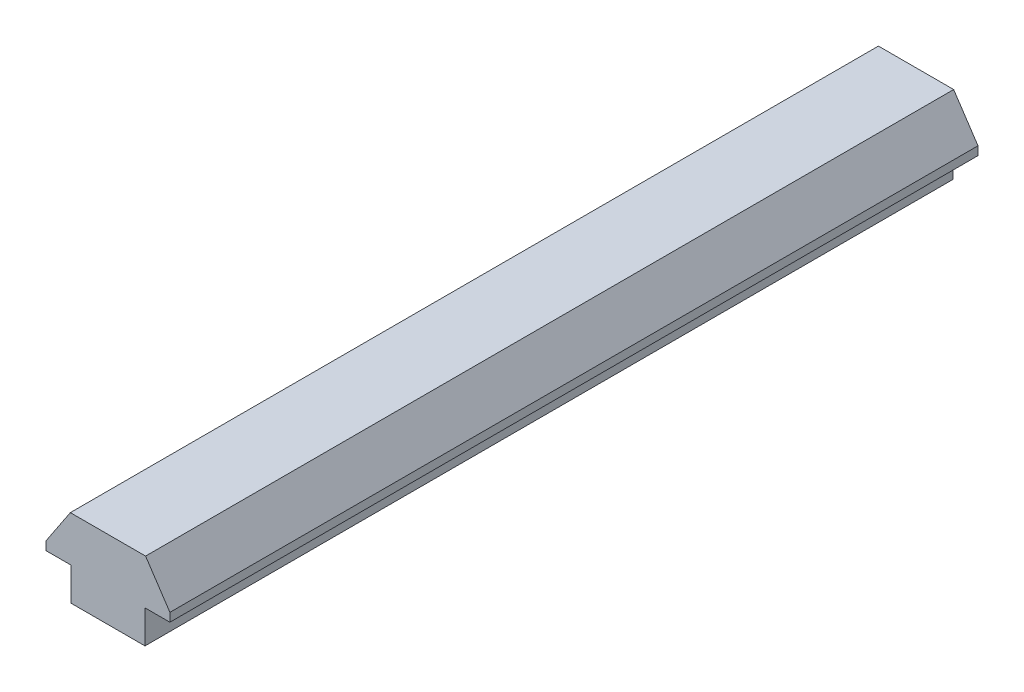
ISO-10303-21;
HEADER;
FILE_DESCRIPTION(('STEP AP214'),'2;1');
FILE_NAME('part.step','',(''),(''),'','','');
FILE_SCHEMA(('AUTOMOTIVE_DESIGN { 1 0 10303 214 1 1 1 1 }'));
ENDSEC;
DATA;
#1=APPLICATION_CONTEXT('core data for automotive mechanical design processes');
#2=APPLICATION_PROTOCOL_DEFINITION('international standard','automotive_design',2000,#1);
#3=PRODUCT_CONTEXT('',#1,'mechanical');
#4=PRODUCT('Part','Part','',(#3));
#5=PRODUCT_RELATED_PRODUCT_CATEGORY('part','',(#4));
#6=PRODUCT_DEFINITION_FORMATION('','',#4);
#7=PRODUCT_DEFINITION_CONTEXT('part definition',#1,'design');
#8=PRODUCT_DEFINITION('design','',#6,#7);
#9=PRODUCT_DEFINITION_SHAPE('','',#8);
#10=(LENGTH_UNIT() NAMED_UNIT(*) SI_UNIT(.MILLI.,.METRE.));
#11=(NAMED_UNIT(*) PLANE_ANGLE_UNIT() SI_UNIT($,.RADIAN.));
#12=(NAMED_UNIT(*) SI_UNIT($,.STERADIAN.) SOLID_ANGLE_UNIT());
#13=UNCERTAINTY_MEASURE_WITH_UNIT(LENGTH_MEASURE(1.E-05),#10,'distance_accuracy_value','');
#14=(GEOMETRIC_REPRESENTATION_CONTEXT(3) GLOBAL_UNCERTAINTY_ASSIGNED_CONTEXT((#13)) GLOBAL_UNIT_ASSIGNED_CONTEXT((#10,
#11,#12)) REPRESENTATION_CONTEXT('',''));
#15=CARTESIAN_POINT('',(0.,0.,0.));
#16=DIRECTION('',(0.,0.,1.));
#17=DIRECTION('',(1.,0.,0.));
#18=AXIS2_PLACEMENT_3D('',#15,#16,#17);
#19=CARTESIAN_POINT('',(-2.75,2.45,66.0210048995163));
#20=DIRECTION('',(1.,0.,0.));
#21=DIRECTION('',(0.,1.,0.));
#22=AXIS2_PLACEMENT_3D('',#19,#20,#21);
#23=PLANE('',#22);
#24=DIRECTION('',(0.,-1.,0.));
#25=VECTOR('',#24,1.);
#26=CARTESIAN_POINT('',(-2.74999999999975,2.44999999999946,60.));
#27=LINE('',#26,#25);
#28=CARTESIAN_POINT('',(-2.75,2.45,60.));
#29=VERTEX_POINT('',#28);
#30=CARTESIAN_POINT('',(-2.74999999999999,0.,60.));
#31=VERTEX_POINT('',#30);
#32=EDGE_CURVE('E205',#29,#31,#27,.T.);
#33=ORIENTED_EDGE('',*,*,#32,.F.);
#34=DIRECTION('',(0.,0.,-1.));
#35=VECTOR('',#34,1.);
#36=CARTESIAN_POINT('',(-2.75,2.45,66.0210048995163));
#37=LINE('',#36,#35);
#38=CARTESIAN_POINT('',(-2.75,2.45,0.));
#39=VERTEX_POINT('',#38);
#40=EDGE_CURVE('E133',#29,#39,#37,.T.);
#41=ORIENTED_EDGE('',*,*,#40,.T.);
#42=DIRECTION('',(0.,-1.,0.));
#43=VECTOR('',#42,1.);
#44=CARTESIAN_POINT('',(-2.75,2.45,0.));
#45=LINE('',#44,#43);
#46=CARTESIAN_POINT('',(-2.74999999999999,0.,0.));
#47=VERTEX_POINT('',#46);
#48=EDGE_CURVE('E136',#39,#47,#45,.T.);
#49=ORIENTED_EDGE('',*,*,#48,.T.);
#50=DIRECTION('',(0.,0.,-1.));
#51=VECTOR('',#50,1.);
#52=CARTESIAN_POINT('',(-2.74999999999999,0.,66.0210048995163));
#53=LINE('',#52,#51);
#54=EDGE_CURVE('E217',#31,#47,#53,.T.);
#55=ORIENTED_EDGE('',*,*,#54,.F.);
#56=EDGE_LOOP('',(#33,#41,#49,#55));
#57=FACE_BOUND('',#56,.T.);
#58=ADVANCED_FACE('F33',(#57),#23,.F.);
#59=CARTESIAN_POINT('',(-2.74999999999999,0.,66.0210048995163));
#60=DIRECTION('',(0.,1.,0.));
#61=DIRECTION('',(0.,0.,1.));
#62=AXIS2_PLACEMENT_3D('',#59,#60,#61);
#63=PLANE('',#62);
#64=DIRECTION('',(1.,0.,0.));
#65=VECTOR('',#64,1.);
#66=CARTESIAN_POINT('',(-2.74999999999999,0.,60.));
#67=LINE('',#66,#65);
#68=CARTESIAN_POINT('',(2.74999999999999,0.,60.));
#69=VERTEX_POINT('',#68);
#70=EDGE_CURVE('E43',#31,#69,#67,.T.);
#71=ORIENTED_EDGE('',*,*,#70,.F.);
#72=ORIENTED_EDGE('',*,*,#54,.T.);
#73=DIRECTION('',(1.,0.,0.));
#74=VECTOR('',#73,1.);
#75=CARTESIAN_POINT('',(-2.74999999999999,0.,0.));
#76=LINE('',#75,#74);
#77=CARTESIAN_POINT('',(2.74999999999999,0.,0.));
#78=VERTEX_POINT('',#77);
#79=EDGE_CURVE('E222',#47,#78,#76,.T.);
#80=ORIENTED_EDGE('',*,*,#79,.T.);
#81=DIRECTION('',(0.,0.,-1.));
#82=VECTOR('',#81,1.);
#83=CARTESIAN_POINT('',(2.74999999999999,0.,66.0210048995163));
#84=LINE('',#83,#82);
#85=EDGE_CURVE('E51',#69,#78,#84,.T.);
#86=ORIENTED_EDGE('',*,*,#85,.F.);
#87=EDGE_LOOP('',(#71,#72,#80,#86));
#88=FACE_BOUND('',#87,.T.);
#89=ADVANCED_FACE('F231',(#88),#63,.F.);
#90=CARTESIAN_POINT('',(2.75,2.45,66.0210048995163));
#91=DIRECTION('',(-1.,0.,0.));
#92=DIRECTION('',(0.,-1.,0.));
#93=AXIS2_PLACEMENT_3D('',#90,#91,#92);
#94=PLANE('',#93);
#95=DIRECTION('',(0.,1.,0.));
#96=VECTOR('',#95,1.);
#97=CARTESIAN_POINT('',(2.75000000000027,2.44999999999946,60.));
#98=LINE('',#97,#96);
#99=CARTESIAN_POINT('',(2.75,2.45,60.));
#100=VERTEX_POINT('',#99);
#101=EDGE_CURVE('E11',#69,#100,#98,.T.);
#102=ORIENTED_EDGE('',*,*,#101,.F.);
#103=ORIENTED_EDGE('',*,*,#85,.T.);
#104=DIRECTION('',(0.,1.,0.));
#105=VECTOR('',#104,1.);
#106=CARTESIAN_POINT('',(2.75,2.45,0.));
#107=LINE('',#106,#105);
#108=CARTESIAN_POINT('',(2.75,2.45,0.));
#109=VERTEX_POINT('',#108);
#110=EDGE_CURVE('E206',#78,#109,#107,.T.);
#111=ORIENTED_EDGE('',*,*,#110,.T.);
#112=DIRECTION('',(0.,0.,-1.));
#113=VECTOR('',#112,1.);
#114=CARTESIAN_POINT('',(2.75,2.45,66.0210048995163));
#115=LINE('',#114,#113);
#116=EDGE_CURVE('E204',#100,#109,#115,.T.);
#117=ORIENTED_EDGE('',*,*,#116,.F.);
#118=EDGE_LOOP('',(#102,#103,#111,#117));
#119=FACE_BOUND('',#118,.T.);
#120=ADVANCED_FACE('F246',(#119),#94,.F.);
#121=CARTESIAN_POINT('',(-2.74999999999999,0.,0.));
#122=DIRECTION('',(0.,0.,1.));
#123=DIRECTION('',(1.,0.,0.));
#124=AXIS2_PLACEMENT_3D('',#121,#122,#123);
#125=PLANE('',#124);
#126=ORIENTED_EDGE('',*,*,#48,.F.);
#127=DIRECTION('',(1.,0.,0.));
#128=VECTOR('',#127,1.);
#129=CARTESIAN_POINT('',(-4.6,2.45,0.));
#130=LINE('',#129,#128);
#131=CARTESIAN_POINT('',(-4.6,2.45,0.));
#132=VERTEX_POINT('',#131);
#133=EDGE_CURVE('E165',#132,#39,#130,.T.);
#134=ORIENTED_EDGE('',*,*,#133,.F.);
#135=DIRECTION('',(0.,-1.,0.));
#136=VECTOR('',#135,1.);
#137=CARTESIAN_POINT('',(-4.6,2.45,0.));
#138=LINE('',#137,#136);
#139=CARTESIAN_POINT('',(-4.6,3.085,0.));
#140=VERTEX_POINT('',#139);
#141=EDGE_CURVE('E141',#140,#132,#138,.T.);
#142=ORIENTED_EDGE('',*,*,#141,.F.);
#143=DIRECTION('',(-0.553850660177017,-0.832616025681396,0.));
#144=VECTOR('',#143,1.);
#145=CARTESIAN_POINT('',(-4.6,3.085,0.));
#146=LINE('',#145,#144);
#147=CARTESIAN_POINT('',(-2.794,5.8,0.));
#148=VERTEX_POINT('',#147);
#149=EDGE_CURVE('E118',#148,#140,#146,.T.);
#150=ORIENTED_EDGE('',*,*,#149,.F.);
#151=DIRECTION('',(-1.,0.,0.));
#152=VECTOR('',#151,1.);
#153=CARTESIAN_POINT('',(-2.794,5.8,0.));
#154=LINE('',#153,#152);
#155=CARTESIAN_POINT('',(2.794,5.8,0.));
#156=VERTEX_POINT('',#155);
#157=EDGE_CURVE('E114',#156,#148,#154,.T.);
#158=ORIENTED_EDGE('',*,*,#157,.F.);
#159=DIRECTION('',(-0.553850660177017,0.832616025681396,0.));
#160=VECTOR('',#159,1.);
#161=CARTESIAN_POINT('',(4.6,3.085,0.));
#162=LINE('',#161,#160);
#163=CARTESIAN_POINT('',(4.6,3.085,0.));
#164=VERTEX_POINT('',#163);
#165=EDGE_CURVE('E158',#164,#156,#162,.T.);
#166=ORIENTED_EDGE('',*,*,#165,.F.);
#167=DIRECTION('',(0.,1.,0.));
#168=VECTOR('',#167,1.);
#169=CARTESIAN_POINT('',(4.6,2.45,0.));
#170=LINE('',#169,#168);
#171=CARTESIAN_POINT('',(4.6,2.45,0.));
#172=VERTEX_POINT('',#171);
#173=EDGE_CURVE('E161',#172,#164,#170,.T.);
#174=ORIENTED_EDGE('',*,*,#173,.F.);
#175=EDGE_CURVE('E167',#109,#172,#130,.T.);
#176=ORIENTED_EDGE('',*,*,#175,.F.);
#177=ORIENTED_EDGE('',*,*,#110,.F.);
#178=ORIENTED_EDGE('',*,*,#79,.F.);
#179=EDGE_LOOP('',(#126,#134,#142,#150,#158,#166,#174,#176,#177,#178));
#180=FACE_BOUND('',#179,.T.);
#181=ADVANCED_FACE('F178',(#180),#125,.F.);
#182=CARTESIAN_POINT('',(13.75,-1.75000000000004,60.));
#183=DIRECTION('',(0.,0.,1.));
#184=DIRECTION('',(0.,1.,0.));
#185=AXIS2_PLACEMENT_3D('',#182,#183,#184);
#186=PLANE('',#185);
#187=ORIENTED_EDGE('',*,*,#32,.T.);
#188=ORIENTED_EDGE('',*,*,#70,.T.);
#189=ORIENTED_EDGE('',*,*,#101,.T.);
#190=DIRECTION('',(1.,0.,0.));
#191=VECTOR('',#190,1.);
#192=CARTESIAN_POINT('',(-4.6,2.45,60.));
#193=LINE('',#192,#191);
#194=CARTESIAN_POINT('',(4.6,2.45,60.));
#195=VERTEX_POINT('',#194);
#196=EDGE_CURVE('E150',#100,#195,#193,.T.);
#197=ORIENTED_EDGE('',*,*,#196,.T.);
#198=DIRECTION('',(0.,1.,0.));
#199=VECTOR('',#198,1.);
#200=CARTESIAN_POINT('',(4.6,2.45,60.));
#201=LINE('',#200,#199);
#202=CARTESIAN_POINT('',(4.6,3.085,60.));
#203=VERTEX_POINT('',#202);
#204=EDGE_CURVE('E138',#195,#203,#201,.T.);
#205=ORIENTED_EDGE('',*,*,#204,.T.);
#206=DIRECTION('',(-0.553850660177017,0.832616025681396,0.));
#207=VECTOR('',#206,1.);
#208=CARTESIAN_POINT('',(4.6,3.085,60.));
#209=LINE('',#208,#207);
#210=CARTESIAN_POINT('',(2.794,5.8,60.));
#211=VERTEX_POINT('',#210);
#212=EDGE_CURVE('E132',#203,#211,#209,.T.);
#213=ORIENTED_EDGE('',*,*,#212,.T.);
#214=DIRECTION('',(-1.,0.,0.));
#215=VECTOR('',#214,1.);
#216=CARTESIAN_POINT('',(-2.794,5.8,60.));
#217=LINE('',#216,#215);
#218=CARTESIAN_POINT('',(-2.794,5.8,60.));
#219=VERTEX_POINT('',#218);
#220=EDGE_CURVE('E111',#211,#219,#217,.T.);
#221=ORIENTED_EDGE('',*,*,#220,.T.);
#222=DIRECTION('',(-0.553850660177017,-0.832616025681396,0.));
#223=VECTOR('',#222,1.);
#224=CARTESIAN_POINT('',(-4.6,3.085,60.));
#225=LINE('',#224,#223);
#226=CARTESIAN_POINT('',(-4.6,3.085,60.));
#227=VERTEX_POINT('',#226);
#228=EDGE_CURVE('E121',#219,#227,#225,.T.);
#229=ORIENTED_EDGE('',*,*,#228,.T.);
#230=DIRECTION('',(0.,-1.,0.));
#231=VECTOR('',#230,1.);
#232=CARTESIAN_POINT('',(-4.6,2.45,60.));
#233=LINE('',#232,#231);
#234=CARTESIAN_POINT('',(-4.6,2.45,60.));
#235=VERTEX_POINT('',#234);
#236=EDGE_CURVE('E127',#227,#235,#233,.T.);
#237=ORIENTED_EDGE('',*,*,#236,.T.);
#238=EDGE_CURVE('E145',#235,#29,#193,.T.);
#239=ORIENTED_EDGE('',*,*,#238,.T.);
#240=EDGE_LOOP('',(#187,#188,#189,#197,#205,#213,#221,#229,#237,#239));
#241=FACE_BOUND('',#240,.T.);
#242=ADVANCED_FACE('F35',(#241),#186,.T.);
#243=CARTESIAN_POINT('',(-4.6,2.45,69.790939689325));
#244=DIRECTION('',(0.,1.,0.));
#245=DIRECTION('',(0.,0.,1.));
#246=AXIS2_PLACEMENT_3D('',#243,#244,#245);
#247=PLANE('',#246);
#248=ORIENTED_EDGE('',*,*,#196,.F.);
#249=ORIENTED_EDGE('',*,*,#116,.T.);
#250=ORIENTED_EDGE('',*,*,#175,.T.);
#251=DIRECTION('',(0.,0.,-1.));
#252=VECTOR('',#251,1.);
#253=CARTESIAN_POINT('',(4.6,2.45,69.790939689325));
#254=LINE('',#253,#252);
#255=EDGE_CURVE('E162',#195,#172,#254,.T.);
#256=ORIENTED_EDGE('',*,*,#255,.F.);
#257=EDGE_LOOP('',(#248,#249,#250,#256));
#258=FACE_BOUND('',#257,.T.);
#259=ADVANCED_FACE('F202',(#258),#247,.F.);
#260=CARTESIAN_POINT('',(-4.6,2.45,69.790939689325));
#261=DIRECTION('',(1.,0.,0.));
#262=DIRECTION('',(0.,0.,-1.));
#263=AXIS2_PLACEMENT_3D('',#260,#261,#262);
#264=PLANE('',#263);
#265=ORIENTED_EDGE('',*,*,#236,.F.);
#266=DIRECTION('',(0.,0.,-1.));
#267=VECTOR('',#266,1.);
#268=CARTESIAN_POINT('',(-4.6,3.085,69.790939689325));
#269=LINE('',#268,#267);
#270=EDGE_CURVE('E123',#227,#140,#269,.T.);
#271=ORIENTED_EDGE('',*,*,#270,.T.);
#272=ORIENTED_EDGE('',*,*,#141,.T.);
#273=DIRECTION('',(0.,0.,-1.));
#274=VECTOR('',#273,1.);
#275=CARTESIAN_POINT('',(-4.6,2.45,69.790939689325));
#276=LINE('',#275,#274);
#277=EDGE_CURVE('E166',#235,#132,#276,.T.);
#278=ORIENTED_EDGE('',*,*,#277,.F.);
#279=EDGE_LOOP('',(#265,#271,#272,#278));
#280=FACE_BOUND('',#279,.T.);
#281=ADVANCED_FACE('F175',(#280),#264,.F.);
#282=ORIENTED_EDGE('',*,*,#40,.F.);
#283=ORIENTED_EDGE('',*,*,#238,.F.);
#284=ORIENTED_EDGE('',*,*,#277,.T.);
#285=ORIENTED_EDGE('',*,*,#133,.T.);
#286=EDGE_LOOP('',(#282,#283,#284,#285));
#287=FACE_BOUND('',#286,.T.);
#288=ADVANCED_FACE('F232',(#287),#247,.F.);
#289=CARTESIAN_POINT('',(4.6,2.45,69.790939689325));
#290=DIRECTION('',(-1.,0.,0.));
#291=DIRECTION('',(0.,0.,1.));
#292=AXIS2_PLACEMENT_3D('',#289,#290,#291);
#293=PLANE('',#292);
#294=ORIENTED_EDGE('',*,*,#204,.F.);
#295=ORIENTED_EDGE('',*,*,#255,.T.);
#296=ORIENTED_EDGE('',*,*,#173,.T.);
#297=DIRECTION('',(0.,0.,-1.));
#298=VECTOR('',#297,1.);
#299=CARTESIAN_POINT('',(4.6,3.085,69.790939689325));
#300=LINE('',#299,#298);
#301=EDGE_CURVE('E159',#203,#164,#300,.T.);
#302=ORIENTED_EDGE('',*,*,#301,.F.);
#303=EDGE_LOOP('',(#294,#295,#296,#302));
#304=FACE_BOUND('',#303,.T.);
#305=ADVANCED_FACE('F199',(#304),#293,.F.);
#306=CARTESIAN_POINT('',(4.6,3.085,69.790939689325));
#307=DIRECTION('',(-0.832616025681396,-0.553850660177017,0.));
#308=DIRECTION('',(0.553850660177017,-0.832616025681396,0.));
#309=AXIS2_PLACEMENT_3D('',#306,#307,#308);
#310=PLANE('',#309);
#311=ORIENTED_EDGE('',*,*,#212,.F.);
#312=ORIENTED_EDGE('',*,*,#301,.T.);
#313=ORIENTED_EDGE('',*,*,#165,.T.);
#314=DIRECTION('',(0.,0.,-1.));
#315=VECTOR('',#314,1.);
#316=CARTESIAN_POINT('',(2.794,5.8,69.790939689325));
#317=LINE('',#316,#315);
#318=EDGE_CURVE('E156',#211,#156,#317,.T.);
#319=ORIENTED_EDGE('',*,*,#318,.F.);
#320=EDGE_LOOP('',(#311,#312,#313,#319));
#321=FACE_BOUND('',#320,.T.);
#322=ADVANCED_FACE('F192',(#321),#310,.F.);
#323=CARTESIAN_POINT('',(-2.794,5.8,69.790939689325));
#324=DIRECTION('',(0.,-1.,0.));
#325=DIRECTION('',(0.,0.,-1.));
#326=AXIS2_PLACEMENT_3D('',#323,#324,#325);
#327=PLANE('',#326);
#328=ORIENTED_EDGE('',*,*,#220,.F.);
#329=ORIENTED_EDGE('',*,*,#318,.T.);
#330=ORIENTED_EDGE('',*,*,#157,.T.);
#331=DIRECTION('',(0.,0.,-1.));
#332=VECTOR('',#331,1.);
#333=CARTESIAN_POINT('',(-2.794,5.8,69.790939689325));
#334=LINE('',#333,#332);
#335=EDGE_CURVE('E107',#219,#148,#334,.T.);
#336=ORIENTED_EDGE('',*,*,#335,.F.);
#337=EDGE_LOOP('',(#328,#329,#330,#336));
#338=FACE_BOUND('',#337,.T.);
#339=ADVANCED_FACE('F109',(#338),#327,.F.);
#340=CARTESIAN_POINT('',(-4.6,3.085,69.790939689325));
#341=DIRECTION('',(0.832616025681396,-0.553850660177017,0.));
#342=DIRECTION('',(0.553850660177017,0.832616025681396,0.));
#343=AXIS2_PLACEMENT_3D('',#340,#341,#342);
#344=PLANE('',#343);
#345=ORIENTED_EDGE('',*,*,#228,.F.);
#346=ORIENTED_EDGE('',*,*,#335,.T.);
#347=ORIENTED_EDGE('',*,*,#149,.T.);
#348=ORIENTED_EDGE('',*,*,#270,.F.);
#349=EDGE_LOOP('',(#345,#346,#347,#348));
#350=FACE_BOUND('',#349,.T.);
#351=ADVANCED_FACE('F122',(#350),#344,.F.);
#352=CLOSED_SHELL('',(#58,#89,#120,#181,#242,#259,#281,#288,#305,#322,#339,#351));
#353=MANIFOLD_SOLID_BREP('B2',#352);
#354=ADVANCED_BREP_SHAPE_REPRESENTATION('',(#18,#353),#14);
#355=SHAPE_DEFINITION_REPRESENTATION(#9,#354);
ENDSEC;
END-ISO-10303-21;
